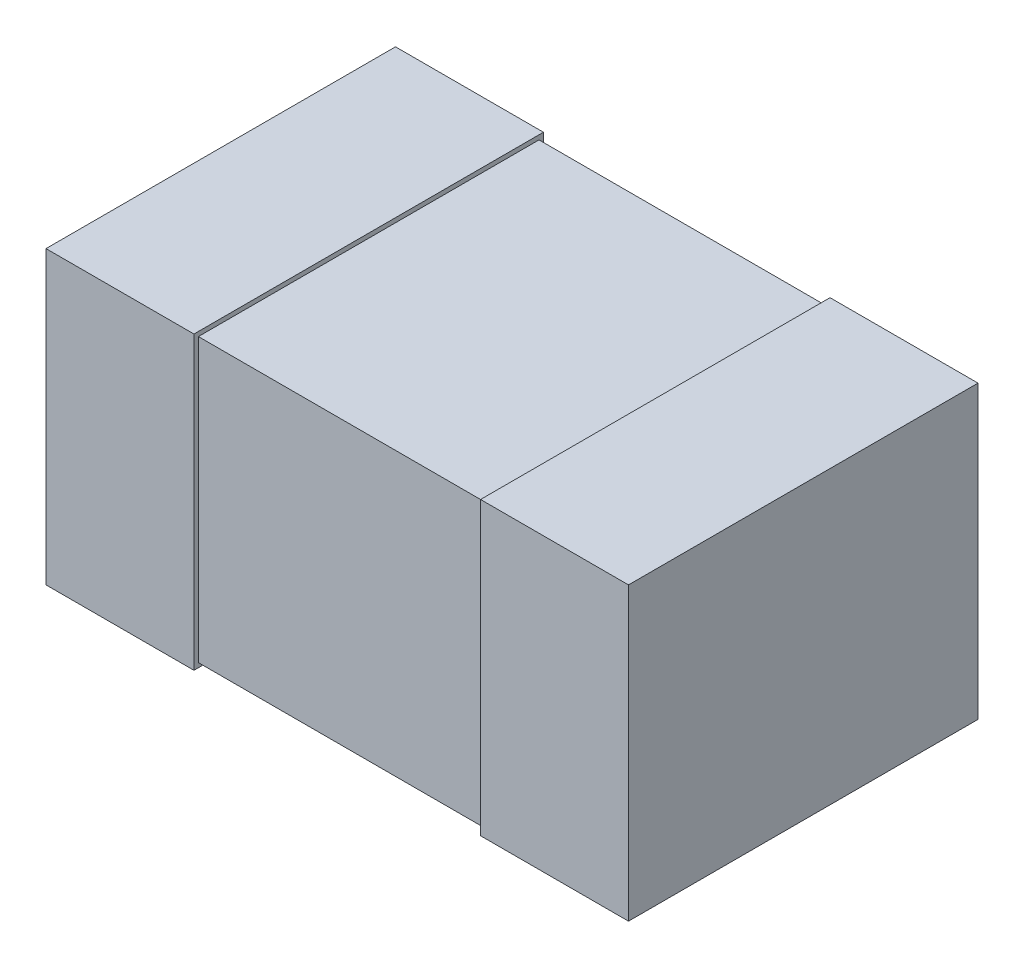
ISO-10303-21;
HEADER;
FILE_DESCRIPTION(('STEP AP214'),'2;1');
FILE_NAME('part.step','',(''),(''),'','','');
FILE_SCHEMA(('AUTOMOTIVE_DESIGN { 1 0 10303 214 1 1 1 1 }'));
ENDSEC;
DATA;
#1=APPLICATION_CONTEXT('core data for automotive mechanical design processes');
#2=APPLICATION_PROTOCOL_DEFINITION('international standard','automotive_design',2000,#1);
#3=PRODUCT_CONTEXT('',#1,'mechanical');
#4=PRODUCT('Part','Part','',(#3));
#5=PRODUCT_RELATED_PRODUCT_CATEGORY('part','',(#4));
#6=PRODUCT_DEFINITION_FORMATION('','',#4);
#7=PRODUCT_DEFINITION_CONTEXT('part definition',#1,'design');
#8=PRODUCT_DEFINITION('design','',#6,#7);
#9=PRODUCT_DEFINITION_SHAPE('','',#8);
#10=(LENGTH_UNIT() NAMED_UNIT(*) SI_UNIT(.MILLI.,.METRE.));
#11=(NAMED_UNIT(*) PLANE_ANGLE_UNIT() SI_UNIT($,.RADIAN.));
#12=(NAMED_UNIT(*) SI_UNIT($,.STERADIAN.) SOLID_ANGLE_UNIT());
#13=UNCERTAINTY_MEASURE_WITH_UNIT(LENGTH_MEASURE(1.E-05),#10,'distance_accuracy_value','');
#14=(GEOMETRIC_REPRESENTATION_CONTEXT(3) GLOBAL_UNCERTAINTY_ASSIGNED_CONTEXT((#13)) GLOBAL_UNIT_ASSIGNED_CONTEXT((#10,
#11,#12)) REPRESENTATION_CONTEXT('',''));
#15=CARTESIAN_POINT('',(0.,0.,0.));
#16=DIRECTION('',(0.,0.,1.));
#17=DIRECTION('',(1.,0.,0.));
#18=AXIS2_PLACEMENT_3D('',#15,#16,#17);
#19=CARTESIAN_POINT('',(0.5,-0.25,0.0762));
#20=DIRECTION('',(1.,0.,0.));
#21=DIRECTION('',(0.,1.,0.));
#22=AXIS2_PLACEMENT_3D('',#19,#20,#21);
#23=PLANE('',#22);
#24=DIRECTION('',(0.,1.,0.));
#25=VECTOR('',#24,1.);
#26=CARTESIAN_POINT('',(0.5,-0.25,0.0762));
#27=LINE('',#26,#25);
#28=CARTESIAN_POINT('',(0.5,-0.25,0.0762));
#29=VERTEX_POINT('',#28);
#30=CARTESIAN_POINT('',(0.5,0.25,0.0762));
#31=VERTEX_POINT('',#30);
#32=EDGE_CURVE('E109',#29,#31,#27,.T.);
#33=ORIENTED_EDGE('',*,*,#32,.T.);
#34=DIRECTION('',(0.,0.,1.));
#35=VECTOR('',#34,1.);
#36=CARTESIAN_POINT('',(0.5,0.25,0.0762));
#37=LINE('',#36,#35);
#38=CARTESIAN_POINT('',(0.5,0.25,0.6762));
#39=VERTEX_POINT('',#38);
#40=EDGE_CURVE('E176',#31,#39,#37,.T.);
#41=ORIENTED_EDGE('',*,*,#40,.T.);
#42=DIRECTION('',(0.,1.,0.));
#43=VECTOR('',#42,1.);
#44=CARTESIAN_POINT('',(0.5,-0.25,0.6762));
#45=LINE('',#44,#43);
#46=CARTESIAN_POINT('',(0.5,-0.25,0.6762));
#47=VERTEX_POINT('',#46);
#48=EDGE_CURVE('E112',#47,#39,#45,.T.);
#49=ORIENTED_EDGE('',*,*,#48,.F.);
#50=DIRECTION('',(0.,0.,1.));
#51=VECTOR('',#50,1.);
#52=CARTESIAN_POINT('',(0.5,-0.25,0.0762));
#53=LINE('',#52,#51);
#54=EDGE_CURVE('E11',#29,#47,#53,.T.);
#55=ORIENTED_EDGE('',*,*,#54,.F.);
#56=EDGE_LOOP('',(#33,#41,#49,#55));
#57=FACE_BOUND('',#56,.T.);
#58=ADVANCED_FACE('F16',(#57),#23,.T.);
#59=CARTESIAN_POINT('',(-0.5,0.25,0.0762));
#60=DIRECTION('',(-1.,0.,0.));
#61=DIRECTION('',(0.,0.,1.));
#62=AXIS2_PLACEMENT_3D('',#59,#60,#61);
#63=PLANE('',#62);
#64=DIRECTION('',(0.,-1.,0.));
#65=VECTOR('',#64,1.);
#66=CARTESIAN_POINT('',(-0.5,0.25,0.0762));
#67=LINE('',#66,#65);
#68=CARTESIAN_POINT('',(-0.5,0.25,0.0762));
#69=VERTEX_POINT('',#68);
#70=CARTESIAN_POINT('',(-0.5,-0.25,0.0762));
#71=VERTEX_POINT('',#70);
#72=EDGE_CURVE('E152',#69,#71,#67,.T.);
#73=ORIENTED_EDGE('',*,*,#72,.T.);
#74=DIRECTION('',(0.,0.,1.));
#75=VECTOR('',#74,1.);
#76=CARTESIAN_POINT('',(-0.5,-0.25,0.0762));
#77=LINE('',#76,#75);
#78=CARTESIAN_POINT('',(-0.5,-0.25,0.6762));
#79=VERTEX_POINT('',#78);
#80=EDGE_CURVE('E27',#71,#79,#77,.T.);
#81=ORIENTED_EDGE('',*,*,#80,.T.);
#82=DIRECTION('',(0.,-1.,0.));
#83=VECTOR('',#82,1.);
#84=CARTESIAN_POINT('',(-0.5,0.25,0.6762));
#85=LINE('',#84,#83);
#86=CARTESIAN_POINT('',(-0.5,0.25,0.6762));
#87=VERTEX_POINT('',#86);
#88=EDGE_CURVE('E147',#87,#79,#85,.T.);
#89=ORIENTED_EDGE('',*,*,#88,.F.);
#90=DIRECTION('',(0.,0.,1.));
#91=VECTOR('',#90,1.);
#92=CARTESIAN_POINT('',(-0.5,0.25,0.0762));
#93=LINE('',#92,#91);
#94=EDGE_CURVE('E169',#69,#87,#93,.T.);
#95=ORIENTED_EDGE('',*,*,#94,.F.);
#96=EDGE_LOOP('',(#73,#81,#89,#95));
#97=FACE_BOUND('',#96,.T.);
#98=ADVANCED_FACE('F266',(#97),#63,.T.);
#99=CARTESIAN_POINT('',(-0.5,-0.25,0.0762));
#100=DIRECTION('',(0.,-1.,0.));
#101=DIRECTION('',(0.,0.,-1.));
#102=AXIS2_PLACEMENT_3D('',#99,#100,#101);
#103=PLANE('',#102);
#104=DIRECTION('',(0.,0.,1.));
#105=VECTOR('',#104,1.);
#106=CARTESIAN_POINT('',(0.246,-0.25,0.0762));
#107=LINE('',#106,#105);
#108=CARTESIAN_POINT('',(0.246,-0.25,0.0762));
#109=VERTEX_POINT('',#108);
#110=CARTESIAN_POINT('',(0.246,-0.25,0.6762));
#111=VERTEX_POINT('',#110);
#112=EDGE_CURVE('E20',#109,#111,#107,.T.);
#113=ORIENTED_EDGE('',*,*,#112,.F.);
#114=DIRECTION('',(1.,0.,0.));
#115=VECTOR('',#114,1.);
#116=CARTESIAN_POINT('',(0.246,-0.25,0.0762));
#117=LINE('',#116,#115);
#118=EDGE_CURVE('E115',#109,#29,#117,.T.);
#119=ORIENTED_EDGE('',*,*,#118,.T.);
#120=ORIENTED_EDGE('',*,*,#54,.T.);
#121=DIRECTION('',(1.,0.,0.));
#122=VECTOR('',#121,1.);
#123=CARTESIAN_POINT('',(0.246,-0.25,0.6762));
#124=LINE('',#123,#122);
#125=EDGE_CURVE('E146',#111,#47,#124,.T.);
#126=ORIENTED_EDGE('',*,*,#125,.F.);
#127=EDGE_LOOP('',(#113,#119,#120,#126));
#128=FACE_BOUND('',#127,.T.);
#129=ADVANCED_FACE('F116',(#128),#103,.T.);
#130=CARTESIAN_POINT('',(-0.5,-0.25,0.0762));
#131=DIRECTION('',(0.,-1.,0.));
#132=DIRECTION('',(0.,0.,-1.));
#133=AXIS2_PLACEMENT_3D('',#130,#131,#132);
#134=PLANE('',#133);
#135=DIRECTION('',(0.,0.,1.));
#136=VECTOR('',#135,1.);
#137=CARTESIAN_POINT('',(-0.246,-0.25,0.0762));
#138=LINE('',#137,#136);
#139=CARTESIAN_POINT('',(-0.246,-0.25,0.0762));
#140=VERTEX_POINT('',#139);
#141=CARTESIAN_POINT('',(-0.246,-0.25,0.6762));
#142=VERTEX_POINT('',#141);
#143=EDGE_CURVE('E243',#140,#142,#138,.T.);
#144=ORIENTED_EDGE('',*,*,#143,.T.);
#145=DIRECTION('',(1.,0.,0.));
#146=VECTOR('',#145,1.);
#147=CARTESIAN_POINT('',(-0.5,-0.25,0.6762));
#148=LINE('',#147,#146);
#149=EDGE_CURVE('E142',#79,#142,#148,.T.);
#150=ORIENTED_EDGE('',*,*,#149,.F.);
#151=ORIENTED_EDGE('',*,*,#80,.F.);
#152=DIRECTION('',(1.,0.,0.));
#153=VECTOR('',#152,1.);
#154=CARTESIAN_POINT('',(-0.5,-0.25,0.0762));
#155=LINE('',#154,#153);
#156=EDGE_CURVE('E196',#71,#140,#155,.T.);
#157=ORIENTED_EDGE('',*,*,#156,.T.);
#158=EDGE_LOOP('',(#144,#150,#151,#157));
#159=FACE_BOUND('',#158,.T.);
#160=ADVANCED_FACE('F312',(#159),#134,.T.);
#161=CARTESIAN_POINT('',(0.,0.,0.6762));
#162=DIRECTION('',(0.,0.,1.));
#163=DIRECTION('',(1.,0.,0.));
#164=AXIS2_PLACEMENT_3D('',#161,#162,#163);
#165=PLANE('',#164);
#166=DIRECTION('',(0.,1.,0.));
#167=VECTOR('',#166,1.);
#168=CARTESIAN_POINT('',(0.246,-0.25,0.6762));
#169=LINE('',#168,#167);
#170=CARTESIAN_POINT('',(0.246,0.25,0.6762));
#171=VERTEX_POINT('',#170);
#172=EDGE_CURVE('E224',#111,#171,#169,.T.);
#173=ORIENTED_EDGE('',*,*,#172,.F.);
#174=ORIENTED_EDGE('',*,*,#125,.T.);
#175=ORIENTED_EDGE('',*,*,#48,.T.);
#176=DIRECTION('',(-1.,0.,0.));
#177=VECTOR('',#176,1.);
#178=CARTESIAN_POINT('',(0.5,0.25,0.6762));
#179=LINE('',#178,#177);
#180=EDGE_CURVE('E182',#39,#171,#179,.T.);
#181=ORIENTED_EDGE('',*,*,#180,.T.);
#182=EDGE_LOOP('',(#173,#174,#175,#181));
#183=FACE_BOUND('',#182,.T.);
#184=ADVANCED_FACE('F284',(#183),#165,.T.);
#185=CARTESIAN_POINT('',(0.,0.,0.6762));
#186=DIRECTION('',(0.,0.,1.));
#187=DIRECTION('',(1.,0.,0.));
#188=AXIS2_PLACEMENT_3D('',#185,#186,#187);
#189=PLANE('',#188);
#190=DIRECTION('',(0.,1.,0.));
#191=VECTOR('',#190,1.);
#192=CARTESIAN_POINT('',(-0.246,-0.25,0.6762));
#193=LINE('',#192,#191);
#194=CARTESIAN_POINT('',(-0.246,0.25,0.6762));
#195=VERTEX_POINT('',#194);
#196=EDGE_CURVE('E216',#142,#195,#193,.T.);
#197=ORIENTED_EDGE('',*,*,#196,.T.);
#198=DIRECTION('',(-1.,0.,0.));
#199=VECTOR('',#198,1.);
#200=CARTESIAN_POINT('',(-0.246,0.25,0.6762));
#201=LINE('',#200,#199);
#202=EDGE_CURVE('E172',#195,#87,#201,.T.);
#203=ORIENTED_EDGE('',*,*,#202,.T.);
#204=ORIENTED_EDGE('',*,*,#88,.T.);
#205=ORIENTED_EDGE('',*,*,#149,.T.);
#206=EDGE_LOOP('',(#197,#203,#204,#205));
#207=FACE_BOUND('',#206,.T.);
#208=ADVANCED_FACE('F254',(#207),#189,.T.);
#209=CARTESIAN_POINT('',(0.5,0.25,0.0762));
#210=DIRECTION('',(0.,1.,0.));
#211=DIRECTION('',(1.,0.,0.));
#212=AXIS2_PLACEMENT_3D('',#209,#210,#211);
#213=PLANE('',#212);
#214=DIRECTION('',(0.,0.,1.));
#215=VECTOR('',#214,1.);
#216=CARTESIAN_POINT('',(0.246,0.25,0.0762));
#217=LINE('',#216,#215);
#218=CARTESIAN_POINT('',(0.246,0.25,0.0762));
#219=VERTEX_POINT('',#218);
#220=EDGE_CURVE('E173',#219,#171,#217,.T.);
#221=ORIENTED_EDGE('',*,*,#220,.T.);
#222=ORIENTED_EDGE('',*,*,#180,.F.);
#223=ORIENTED_EDGE('',*,*,#40,.F.);
#224=DIRECTION('',(-1.,0.,0.));
#225=VECTOR('',#224,1.);
#226=CARTESIAN_POINT('',(0.5,0.25,0.0762));
#227=LINE('',#226,#225);
#228=EDGE_CURVE('E126',#31,#219,#227,.T.);
#229=ORIENTED_EDGE('',*,*,#228,.T.);
#230=EDGE_LOOP('',(#221,#222,#223,#229));
#231=FACE_BOUND('',#230,.T.);
#232=ADVANCED_FACE('F332',(#231),#213,.T.);
#233=CARTESIAN_POINT('',(0.5,0.25,0.0762));
#234=DIRECTION('',(0.,1.,0.));
#235=DIRECTION('',(1.,0.,0.));
#236=AXIS2_PLACEMENT_3D('',#233,#234,#235);
#237=PLANE('',#236);
#238=DIRECTION('',(0.,0.,1.));
#239=VECTOR('',#238,1.);
#240=CARTESIAN_POINT('',(-0.246,0.25,0.0762));
#241=LINE('',#240,#239);
#242=CARTESIAN_POINT('',(-0.246,0.25,0.0762));
#243=VERTEX_POINT('',#242);
#244=EDGE_CURVE('E122',#243,#195,#241,.T.);
#245=ORIENTED_EDGE('',*,*,#244,.F.);
#246=DIRECTION('',(-1.,0.,0.));
#247=VECTOR('',#246,1.);
#248=CARTESIAN_POINT('',(-0.246,0.25,0.0762));
#249=LINE('',#248,#247);
#250=EDGE_CURVE('E148',#243,#69,#249,.T.);
#251=ORIENTED_EDGE('',*,*,#250,.T.);
#252=ORIENTED_EDGE('',*,*,#94,.T.);
#253=ORIENTED_EDGE('',*,*,#202,.F.);
#254=EDGE_LOOP('',(#245,#251,#252,#253));
#255=FACE_BOUND('',#254,.T.);
#256=ADVANCED_FACE('F258',(#255),#237,.T.);
#257=CARTESIAN_POINT('',(0.246,-0.25,0.08382));
#258=DIRECTION('',(1.,0.,0.));
#259=DIRECTION('',(0.,1.,0.));
#260=AXIS2_PLACEMENT_3D('',#257,#258,#259);
#261=PLANE('',#260);
#262=DIRECTION('',(0.,1.,0.));
#263=VECTOR('',#262,1.);
#264=CARTESIAN_POINT('',(0.246,-0.24238,0.08382));
#265=LINE('',#264,#263);
#266=CARTESIAN_POINT('',(0.246,-0.24238,0.08382));
#267=VERTEX_POINT('',#266);
#268=CARTESIAN_POINT('',(0.246,0.24238,0.08382));
#269=VERTEX_POINT('',#268);
#270=EDGE_CURVE('E234',#267,#269,#265,.T.);
#271=ORIENTED_EDGE('',*,*,#270,.T.);
#272=DIRECTION('',(0.,0.,1.));
#273=VECTOR('',#272,1.);
#274=CARTESIAN_POINT('',(0.246,0.24238,0.08382));
#275=LINE('',#274,#273);
#276=CARTESIAN_POINT('',(0.246,0.24238,0.66858));
#277=VERTEX_POINT('',#276);
#278=EDGE_CURVE('E168',#269,#277,#275,.T.);
#279=ORIENTED_EDGE('',*,*,#278,.T.);
#280=DIRECTION('',(0.,-1.,0.));
#281=VECTOR('',#280,1.);
#282=CARTESIAN_POINT('',(0.246,0.24238,0.66858));
#283=LINE('',#282,#281);
#284=CARTESIAN_POINT('',(0.246,-0.24238,0.66858));
#285=VERTEX_POINT('',#284);
#286=EDGE_CURVE('E140',#277,#285,#283,.T.);
#287=ORIENTED_EDGE('',*,*,#286,.T.);
#288=DIRECTION('',(0.,0.,-1.));
#289=VECTOR('',#288,1.);
#290=CARTESIAN_POINT('',(0.246,-0.24238,0.66858));
#291=LINE('',#290,#289);
#292=EDGE_CURVE('E141',#285,#267,#291,.T.);
#293=ORIENTED_EDGE('',*,*,#292,.T.);
#294=EDGE_LOOP('',(#271,#279,#287,#293));
#295=FACE_BOUND('',#294,.T.);
#296=DIRECTION('',(0.,1.,0.));
#297=VECTOR('',#296,1.);
#298=CARTESIAN_POINT('',(0.246,-0.25,0.0762));
#299=LINE('',#298,#297);
#300=EDGE_CURVE('E133',#109,#219,#299,.T.);
#301=ORIENTED_EDGE('',*,*,#300,.F.);
#302=ORIENTED_EDGE('',*,*,#112,.T.);
#303=ORIENTED_EDGE('',*,*,#172,.T.);
#304=ORIENTED_EDGE('',*,*,#220,.F.);
#305=EDGE_LOOP('',(#301,#302,#303,#304));
#306=FACE_BOUND('',#305,.T.);
#307=ADVANCED_FACE('F289',(#295,#306),#261,.F.);
#308=CARTESIAN_POINT('',(-0.246,-0.25,0.08382));
#309=DIRECTION('',(0.,0.,1.));
#310=DIRECTION('',(1.,0.,0.));
#311=AXIS2_PLACEMENT_3D('',#308,#309,#310);
#312=PLANE('',#311);
#313=DIRECTION('',(1.,0.,0.));
#314=VECTOR('',#313,1.);
#315=CARTESIAN_POINT('',(-0.246,-0.24238,0.08382));
#316=LINE('',#315,#314);
#317=CARTESIAN_POINT('',(-0.246,-0.24238,0.08382));
#318=VERTEX_POINT('',#317);
#319=EDGE_CURVE('E153',#318,#267,#316,.T.);
#320=ORIENTED_EDGE('',*,*,#319,.F.);
#321=DIRECTION('',(0.,1.,0.));
#322=VECTOR('',#321,1.);
#323=CARTESIAN_POINT('',(-0.246,-0.24238,0.08382));
#324=LINE('',#323,#322);
#325=CARTESIAN_POINT('',(-0.246,0.24238,0.08382));
#326=VERTEX_POINT('',#325);
#327=EDGE_CURVE('E233',#318,#326,#324,.T.);
#328=ORIENTED_EDGE('',*,*,#327,.T.);
#329=DIRECTION('',(1.,0.,0.));
#330=VECTOR('',#329,1.);
#331=CARTESIAN_POINT('',(-0.246,0.24238,0.08382));
#332=LINE('',#331,#330);
#333=EDGE_CURVE('E164',#326,#269,#332,.T.);
#334=ORIENTED_EDGE('',*,*,#333,.T.);
#335=ORIENTED_EDGE('',*,*,#270,.F.);
#336=EDGE_LOOP('',(#320,#328,#334,#335));
#337=FACE_BOUND('',#336,.T.);
#338=ADVANCED_FACE('F344',(#337),#312,.F.);
#339=CARTESIAN_POINT('',(-0.246,0.24238,0.0762));
#340=DIRECTION('',(0.,-1.,0.));
#341=DIRECTION('',(0.,0.,-1.));
#342=AXIS2_PLACEMENT_3D('',#339,#340,#341);
#343=PLANE('',#342);
#344=ORIENTED_EDGE('',*,*,#333,.F.);
#345=DIRECTION('',(0.,0.,1.));
#346=VECTOR('',#345,1.);
#347=CARTESIAN_POINT('',(-0.246,0.24238,0.08382));
#348=LINE('',#347,#346);
#349=CARTESIAN_POINT('',(-0.246,0.24238,0.66858));
#350=VERTEX_POINT('',#349);
#351=EDGE_CURVE('E162',#326,#350,#348,.T.);
#352=ORIENTED_EDGE('',*,*,#351,.T.);
#353=DIRECTION('',(1.,0.,0.));
#354=VECTOR('',#353,1.);
#355=CARTESIAN_POINT('',(-0.246,0.24238,0.66858));
#356=LINE('',#355,#354);
#357=EDGE_CURVE('E137',#350,#277,#356,.T.);
#358=ORIENTED_EDGE('',*,*,#357,.T.);
#359=ORIENTED_EDGE('',*,*,#278,.F.);
#360=EDGE_LOOP('',(#344,#352,#358,#359));
#361=FACE_BOUND('',#360,.T.);
#362=ADVANCED_FACE('F339',(#361),#343,.F.);
#363=CARTESIAN_POINT('',(-0.246,0.25,0.66858));
#364=DIRECTION('',(0.,0.,-1.));
#365=DIRECTION('',(0.,-1.,0.));
#366=AXIS2_PLACEMENT_3D('',#363,#364,#365);
#367=PLANE('',#366);
#368=ORIENTED_EDGE('',*,*,#357,.F.);
#369=DIRECTION('',(0.,-1.,0.));
#370=VECTOR('',#369,1.);
#371=CARTESIAN_POINT('',(-0.246,0.24238,0.66858));
#372=LINE('',#371,#370);
#373=CARTESIAN_POINT('',(-0.246,-0.24238,0.66858));
#374=VERTEX_POINT('',#373);
#375=EDGE_CURVE('E158',#350,#374,#372,.T.);
#376=ORIENTED_EDGE('',*,*,#375,.T.);
#377=DIRECTION('',(1.,0.,0.));
#378=VECTOR('',#377,1.);
#379=CARTESIAN_POINT('',(-0.246,-0.24238,0.66858));
#380=LINE('',#379,#378);
#381=EDGE_CURVE('E157',#374,#285,#380,.T.);
#382=ORIENTED_EDGE('',*,*,#381,.T.);
#383=ORIENTED_EDGE('',*,*,#286,.F.);
#384=EDGE_LOOP('',(#368,#376,#382,#383));
#385=FACE_BOUND('',#384,.T.);
#386=ADVANCED_FACE('F299',(#385),#367,.F.);
#387=CARTESIAN_POINT('',(-0.246,-0.24238,0.6762));
#388=DIRECTION('',(0.,1.,0.));
#389=DIRECTION('',(1.,0.,0.));
#390=AXIS2_PLACEMENT_3D('',#387,#388,#389);
#391=PLANE('',#390);
#392=ORIENTED_EDGE('',*,*,#381,.F.);
#393=DIRECTION('',(0.,0.,-1.));
#394=VECTOR('',#393,1.);
#395=CARTESIAN_POINT('',(-0.246,-0.24238,0.66858));
#396=LINE('',#395,#394);
#397=EDGE_CURVE('E163',#374,#318,#396,.T.);
#398=ORIENTED_EDGE('',*,*,#397,.T.);
#399=ORIENTED_EDGE('',*,*,#319,.T.);
#400=ORIENTED_EDGE('',*,*,#292,.F.);
#401=EDGE_LOOP('',(#392,#398,#399,#400));
#402=FACE_BOUND('',#401,.T.);
#403=ADVANCED_FACE('F294',(#402),#391,.F.);
#404=CARTESIAN_POINT('',(-0.246,-0.25,0.0762));
#405=DIRECTION('',(-1.,0.,0.));
#406=DIRECTION('',(0.,0.,1.));
#407=AXIS2_PLACEMENT_3D('',#404,#405,#406);
#408=PLANE('',#407);
#409=ORIENTED_EDGE('',*,*,#397,.F.);
#410=ORIENTED_EDGE('',*,*,#375,.F.);
#411=ORIENTED_EDGE('',*,*,#351,.F.);
#412=ORIENTED_EDGE('',*,*,#327,.F.);
#413=EDGE_LOOP('',(#409,#410,#411,#412));
#414=FACE_BOUND('',#413,.T.);
#415=DIRECTION('',(0.,1.,0.));
#416=VECTOR('',#415,1.);
#417=CARTESIAN_POINT('',(-0.246,-0.25,0.0762));
#418=LINE('',#417,#416);
#419=EDGE_CURVE('E194',#140,#243,#418,.T.);
#420=ORIENTED_EDGE('',*,*,#419,.T.);
#421=ORIENTED_EDGE('',*,*,#244,.T.);
#422=ORIENTED_EDGE('',*,*,#196,.F.);
#423=ORIENTED_EDGE('',*,*,#143,.F.);
#424=EDGE_LOOP('',(#420,#421,#422,#423));
#425=FACE_BOUND('',#424,.T.);
#426=ADVANCED_FACE('F18',(#414,#425),#408,.F.);
#427=CARTESIAN_POINT('',(0.,0.,0.0762));
#428=DIRECTION('',(0.,0.,1.));
#429=DIRECTION('',(1.,0.,0.));
#430=AXIS2_PLACEMENT_3D('',#427,#428,#429);
#431=PLANE('',#430);
#432=ORIENTED_EDGE('',*,*,#300,.T.);
#433=ORIENTED_EDGE('',*,*,#228,.F.);
#434=ORIENTED_EDGE('',*,*,#32,.F.);
#435=ORIENTED_EDGE('',*,*,#118,.F.);
#436=EDGE_LOOP('',(#432,#433,#434,#435));
#437=FACE_BOUND('',#436,.T.);
#438=ADVANCED_FACE('F124',(#437),#431,.F.);
#439=CARTESIAN_POINT('',(0.,0.,0.0762));
#440=DIRECTION('',(0.,0.,1.));
#441=DIRECTION('',(1.,0.,0.));
#442=AXIS2_PLACEMENT_3D('',#439,#440,#441);
#443=PLANE('',#442);
#444=ORIENTED_EDGE('',*,*,#419,.F.);
#445=ORIENTED_EDGE('',*,*,#156,.F.);
#446=ORIENTED_EDGE('',*,*,#72,.F.);
#447=ORIENTED_EDGE('',*,*,#250,.F.);
#448=EDGE_LOOP('',(#444,#445,#446,#447));
#449=FACE_BOUND('',#448,.T.);
#450=ADVANCED_FACE('F261',(#449),#443,.F.);
#451=CLOSED_SHELL('',(#58,#98,#129,#160,#184,#208,#232,#256,#307,#338,#362,#386,#403,#426,#438,#450));
#452=MANIFOLD_SOLID_BREP('B1',#451);
#453=ADVANCED_BREP_SHAPE_REPRESENTATION('',(#18,#452),#14);
#454=SHAPE_DEFINITION_REPRESENTATION(#9,#453);
ENDSEC;
END-ISO-10303-21;
